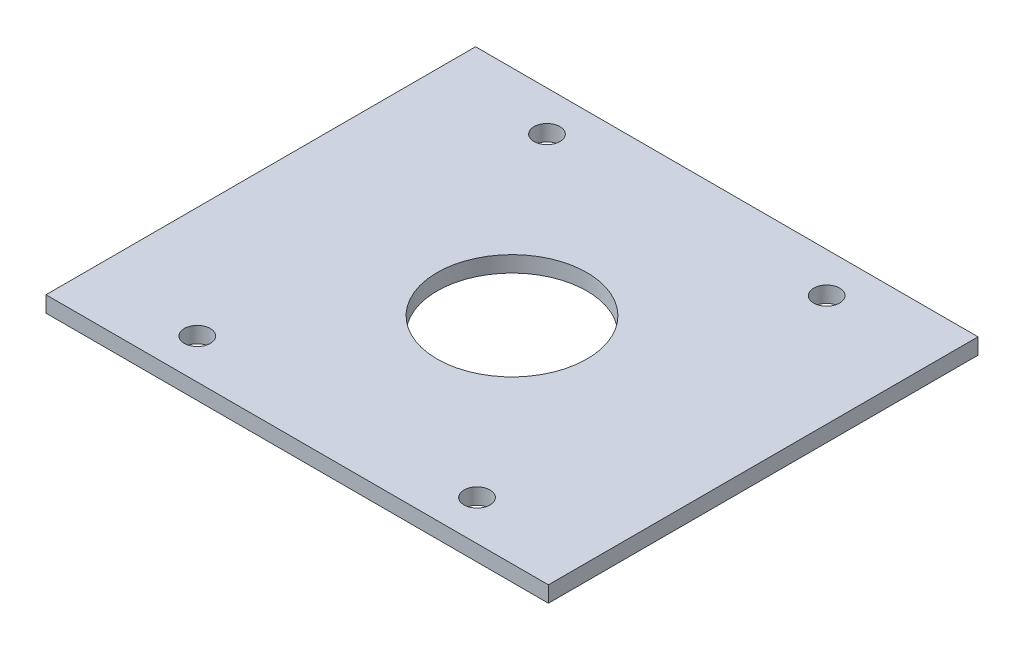
ISO-10303-21;
HEADER;
FILE_DESCRIPTION(('STEP AP214'),'2;1');
FILE_NAME('part.step','',(''),(''),'','','');
FILE_SCHEMA(('AUTOMOTIVE_DESIGN { 1 0 10303 214 1 1 1 1 }'));
ENDSEC;
DATA;
#1=APPLICATION_CONTEXT('core data for automotive mechanical design processes');
#2=APPLICATION_PROTOCOL_DEFINITION('international standard','automotive_design',2000,#1);
#3=PRODUCT_CONTEXT('',#1,'mechanical');
#4=PRODUCT('Part','Part','',(#3));
#5=PRODUCT_RELATED_PRODUCT_CATEGORY('part','',(#4));
#6=PRODUCT_DEFINITION_FORMATION('','',#4);
#7=PRODUCT_DEFINITION_CONTEXT('part definition',#1,'design');
#8=PRODUCT_DEFINITION('design','',#6,#7);
#9=PRODUCT_DEFINITION_SHAPE('','',#8);
#10=(LENGTH_UNIT() NAMED_UNIT(*) SI_UNIT(.MILLI.,.METRE.));
#11=(NAMED_UNIT(*) PLANE_ANGLE_UNIT() SI_UNIT($,.RADIAN.));
#12=(NAMED_UNIT(*) SI_UNIT($,.STERADIAN.) SOLID_ANGLE_UNIT());
#13=UNCERTAINTY_MEASURE_WITH_UNIT(LENGTH_MEASURE(1.E-05),#10,'distance_accuracy_value','');
#14=(GEOMETRIC_REPRESENTATION_CONTEXT(3) GLOBAL_UNCERTAINTY_ASSIGNED_CONTEXT((#13)) GLOBAL_UNIT_ASSIGNED_CONTEXT((#10,
#11,#12)) REPRESENTATION_CONTEXT('',''));
#15=CARTESIAN_POINT('',(0.,0.,0.));
#16=DIRECTION('',(0.,0.,1.));
#17=DIRECTION('',(1.,0.,0.));
#18=AXIS2_PLACEMENT_3D('',#15,#16,#17);
#19=CARTESIAN_POINT('',(0.,1.6,0.));
#20=DIRECTION('',(0.,1.,0.));
#21=DIRECTION('',(0.,0.,1.));
#22=AXIS2_PLACEMENT_3D('',#19,#20,#21);
#23=PLANE('',#22);
#24=CARTESIAN_POINT('',(-14.,1.6,17.5));
#25=DIRECTION('',(0.,1.,0.));
#26=DIRECTION('',(0.,0.,-1.));
#27=AXIS2_PLACEMENT_3D('',#24,#25,#26);
#28=CIRCLE('',#27,1.3);
#29=CARTESIAN_POINT('',(-14.,1.6,16.2));
#30=VERTEX_POINT('',#29);
#31=EDGE_CURVE('E131',#30,#30,#28,.T.);
#32=ORIENTED_EDGE('',*,*,#31,.F.);
#33=EDGE_LOOP('',(#32));
#34=FACE_BOUND('',#33,.T.);
#35=CARTESIAN_POINT('',(14.,1.6,17.5));
#36=DIRECTION('',(0.,1.,0.));
#37=DIRECTION('',(0.,0.,1.));
#38=AXIS2_PLACEMENT_3D('',#35,#36,#37);
#39=CIRCLE('',#38,1.3);
#40=CARTESIAN_POINT('',(14.,1.6,18.8));
#41=VERTEX_POINT('',#40);
#42=EDGE_CURVE('E137',#41,#41,#39,.T.);
#43=ORIENTED_EDGE('',*,*,#42,.F.);
#44=EDGE_LOOP('',(#43));
#45=FACE_BOUND('',#44,.T.);
#46=CARTESIAN_POINT('',(14.,1.6,-17.5));
#47=DIRECTION('',(0.,1.,0.));
#48=DIRECTION('',(0.,0.,-1.));
#49=AXIS2_PLACEMENT_3D('',#46,#47,#48);
#50=CIRCLE('',#49,1.3);
#51=CARTESIAN_POINT('',(14.,1.6,-18.8));
#52=VERTEX_POINT('',#51);
#53=EDGE_CURVE('E125',#52,#52,#50,.T.);
#54=ORIENTED_EDGE('',*,*,#53,.F.);
#55=EDGE_LOOP('',(#54));
#56=FACE_BOUND('',#55,.T.);
#57=CARTESIAN_POINT('',(-14.,1.6,-17.5));
#58=DIRECTION('',(0.,1.,0.));
#59=DIRECTION('',(0.,0.,1.));
#60=AXIS2_PLACEMENT_3D('',#57,#58,#59);
#61=CIRCLE('',#60,1.3);
#62=CARTESIAN_POINT('',(-14.,1.6,-16.2));
#63=VERTEX_POINT('',#62);
#64=EDGE_CURVE('E119',#63,#63,#61,.T.);
#65=ORIENTED_EDGE('',*,*,#64,.F.);
#66=EDGE_LOOP('',(#65));
#67=FACE_BOUND('',#66,.T.);
#68=DIRECTION('',(0.,0.,-1.));
#69=VECTOR('',#68,1.);
#70=CARTESIAN_POINT('',(25.146,1.6,-21.5));
#71=LINE('',#70,#69);
#72=CARTESIAN_POINT('',(25.146,1.6,21.5));
#73=VERTEX_POINT('',#72);
#74=CARTESIAN_POINT('',(25.146,1.6,-21.5));
#75=VERTEX_POINT('',#74);
#76=EDGE_CURVE('E89',#73,#75,#71,.T.);
#77=ORIENTED_EDGE('',*,*,#76,.T.);
#78=DIRECTION('',(-1.,0.,0.));
#79=VECTOR('',#78,1.);
#80=CARTESIAN_POINT('',(-25.146,1.6,-21.5));
#81=LINE('',#80,#79);
#82=CARTESIAN_POINT('',(-25.146,1.6,-21.5));
#83=VERTEX_POINT('',#82);
#84=EDGE_CURVE('E84',#75,#83,#81,.T.);
#85=ORIENTED_EDGE('',*,*,#84,.T.);
#86=DIRECTION('',(0.,0.,1.));
#87=VECTOR('',#86,1.);
#88=CARTESIAN_POINT('',(-25.146,1.6,-21.5));
#89=LINE('',#88,#87);
#90=CARTESIAN_POINT('',(-25.146,1.6,21.5));
#91=VERTEX_POINT('',#90);
#92=EDGE_CURVE('E87',#83,#91,#89,.T.);
#93=ORIENTED_EDGE('',*,*,#92,.T.);
#94=DIRECTION('',(1.,0.,0.));
#95=VECTOR('',#94,1.);
#96=CARTESIAN_POINT('',(-25.146,1.6,21.5));
#97=LINE('',#96,#95);
#98=EDGE_CURVE('E54',#91,#73,#97,.T.);
#99=ORIENTED_EDGE('',*,*,#98,.T.);
#100=EDGE_LOOP('',(#77,#85,#93,#99));
#101=FACE_BOUND('',#100,.T.);
#102=CARTESIAN_POINT('',(0.,1.6,0.));
#103=DIRECTION('',(0.,1.,0.));
#104=DIRECTION('',(0.,0.,1.));
#105=AXIS2_PLACEMENT_3D('',#102,#103,#104);
#106=CIRCLE('',#105,7.5);
#107=CARTESIAN_POINT('',(0.,1.6,7.5));
#108=VERTEX_POINT('',#107);
#109=EDGE_CURVE('E104',#108,#108,#106,.T.);
#110=ORIENTED_EDGE('',*,*,#109,.F.);
#111=EDGE_LOOP('',(#110));
#112=FACE_BOUND('',#111,.T.);
#113=ADVANCED_FACE('F37',(#34,#45,#56,#67,#101,#112),#23,.T.);
#114=CARTESIAN_POINT('',(0.,0.,0.));
#115=DIRECTION('',(0.,1.,0.));
#116=DIRECTION('',(0.,0.,1.));
#117=AXIS2_PLACEMENT_3D('',#114,#115,#116);
#118=PLANE('',#117);
#119=CARTESIAN_POINT('',(-14.,0.,17.5));
#120=DIRECTION('',(0.,1.,0.));
#121=DIRECTION('',(0.,0.,-1.));
#122=AXIS2_PLACEMENT_3D('',#119,#120,#121);
#123=CIRCLE('',#122,1.3);
#124=CARTESIAN_POINT('',(-14.,0.,16.2));
#125=VERTEX_POINT('',#124);
#126=EDGE_CURVE('E128',#125,#125,#123,.T.);
#127=ORIENTED_EDGE('',*,*,#126,.T.);
#128=EDGE_LOOP('',(#127));
#129=FACE_BOUND('',#128,.T.);
#130=CARTESIAN_POINT('',(14.,0.,17.5));
#131=DIRECTION('',(0.,1.,0.));
#132=DIRECTION('',(0.,0.,1.));
#133=AXIS2_PLACEMENT_3D('',#130,#131,#132);
#134=CIRCLE('',#133,1.3);
#135=CARTESIAN_POINT('',(14.,0.,18.8));
#136=VERTEX_POINT('',#135);
#137=EDGE_CURVE('E134',#136,#136,#134,.T.);
#138=ORIENTED_EDGE('',*,*,#137,.T.);
#139=EDGE_LOOP('',(#138));
#140=FACE_BOUND('',#139,.T.);
#141=CARTESIAN_POINT('',(14.,0.,-17.5));
#142=DIRECTION('',(0.,1.,0.));
#143=DIRECTION('',(0.,0.,-1.));
#144=AXIS2_PLACEMENT_3D('',#141,#142,#143);
#145=CIRCLE('',#144,1.3);
#146=CARTESIAN_POINT('',(14.,0.,-18.8));
#147=VERTEX_POINT('',#146);
#148=EDGE_CURVE('E140',#147,#147,#145,.T.);
#149=ORIENTED_EDGE('',*,*,#148,.T.);
#150=EDGE_LOOP('',(#149));
#151=FACE_BOUND('',#150,.T.);
#152=CARTESIAN_POINT('',(-14.,0.,-17.5));
#153=DIRECTION('',(0.,1.,0.));
#154=DIRECTION('',(0.,0.,1.));
#155=AXIS2_PLACEMENT_3D('',#152,#153,#154);
#156=CIRCLE('',#155,1.3);
#157=CARTESIAN_POINT('',(-14.,0.,-16.2));
#158=VERTEX_POINT('',#157);
#159=EDGE_CURVE('E122',#158,#158,#156,.T.);
#160=ORIENTED_EDGE('',*,*,#159,.T.);
#161=EDGE_LOOP('',(#160));
#162=FACE_BOUND('',#161,.T.);
#163=DIRECTION('',(0.,0.,-1.));
#164=VECTOR('',#163,1.);
#165=CARTESIAN_POINT('',(25.146,0.,-21.5));
#166=LINE('',#165,#164);
#167=CARTESIAN_POINT('',(25.146,0.,21.5));
#168=VERTEX_POINT('',#167);
#169=CARTESIAN_POINT('',(25.146,0.,-21.5));
#170=VERTEX_POINT('',#169);
#171=EDGE_CURVE('E101',#168,#170,#166,.T.);
#172=ORIENTED_EDGE('',*,*,#171,.F.);
#173=DIRECTION('',(1.,0.,0.));
#174=VECTOR('',#173,1.);
#175=CARTESIAN_POINT('',(-25.146,0.,21.5));
#176=LINE('',#175,#174);
#177=CARTESIAN_POINT('',(-25.146,0.,21.5));
#178=VERTEX_POINT('',#177);
#179=EDGE_CURVE('E77',#178,#168,#176,.T.);
#180=ORIENTED_EDGE('',*,*,#179,.F.);
#181=DIRECTION('',(0.,0.,1.));
#182=VECTOR('',#181,1.);
#183=CARTESIAN_POINT('',(-25.146,0.,-21.5));
#184=LINE('',#183,#182);
#185=CARTESIAN_POINT('',(-25.146,0.,-21.5));
#186=VERTEX_POINT('',#185);
#187=EDGE_CURVE('E71',#186,#178,#184,.T.);
#188=ORIENTED_EDGE('',*,*,#187,.F.);
#189=DIRECTION('',(-1.,0.,0.));
#190=VECTOR('',#189,1.);
#191=CARTESIAN_POINT('',(-25.146,0.,-21.5));
#192=LINE('',#191,#190);
#193=EDGE_CURVE('E93',#170,#186,#192,.T.);
#194=ORIENTED_EDGE('',*,*,#193,.F.);
#195=EDGE_LOOP('',(#172,#180,#188,#194));
#196=FACE_BOUND('',#195,.T.);
#197=CARTESIAN_POINT('',(0.,0.,0.));
#198=DIRECTION('',(0.,1.,0.));
#199=DIRECTION('',(0.,0.,1.));
#200=AXIS2_PLACEMENT_3D('',#197,#198,#199);
#201=CIRCLE('',#200,7.5);
#202=CARTESIAN_POINT('',(0.,0.,7.5));
#203=VERTEX_POINT('',#202);
#204=EDGE_CURVE('E116',#203,#203,#201,.T.);
#205=ORIENTED_EDGE('',*,*,#204,.T.);
#206=EDGE_LOOP('',(#205));
#207=FACE_BOUND('',#206,.T.);
#208=ADVANCED_FACE('F112',(#129,#140,#151,#162,#196,#207),#118,.F.);
#209=CARTESIAN_POINT('',(25.146,1.6,-21.5));
#210=DIRECTION('',(-1.,0.,0.));
#211=DIRECTION('',(0.,0.,1.));
#212=AXIS2_PLACEMENT_3D('',#209,#210,#211);
#213=PLANE('',#212);
#214=ORIENTED_EDGE('',*,*,#171,.T.);
#215=DIRECTION('',(0.,-1.,0.));
#216=VECTOR('',#215,1.);
#217=CARTESIAN_POINT('',(25.146,1.6,-21.5));
#218=LINE('',#217,#216);
#219=EDGE_CURVE('E11',#75,#170,#218,.T.);
#220=ORIENTED_EDGE('',*,*,#219,.F.);
#221=ORIENTED_EDGE('',*,*,#76,.F.);
#222=DIRECTION('',(0.,-1.,0.));
#223=VECTOR('',#222,1.);
#224=CARTESIAN_POINT('',(25.146,1.6,21.5));
#225=LINE('',#224,#223);
#226=EDGE_CURVE('E97',#73,#168,#225,.T.);
#227=ORIENTED_EDGE('',*,*,#226,.T.);
#228=EDGE_LOOP('',(#214,#220,#221,#227));
#229=FACE_BOUND('',#228,.T.);
#230=ADVANCED_FACE('F39',(#229),#213,.F.);
#231=CARTESIAN_POINT('',(-25.146,1.6,-21.5));
#232=DIRECTION('',(0.,0.,1.));
#233=DIRECTION('',(1.,0.,0.));
#234=AXIS2_PLACEMENT_3D('',#231,#232,#233);
#235=PLANE('',#234);
#236=ORIENTED_EDGE('',*,*,#193,.T.);
#237=DIRECTION('',(0.,-1.,0.));
#238=VECTOR('',#237,1.);
#239=CARTESIAN_POINT('',(-25.146,1.6,-21.5));
#240=LINE('',#239,#238);
#241=EDGE_CURVE('E46',#83,#186,#240,.T.);
#242=ORIENTED_EDGE('',*,*,#241,.F.);
#243=ORIENTED_EDGE('',*,*,#84,.F.);
#244=ORIENTED_EDGE('',*,*,#219,.T.);
#245=EDGE_LOOP('',(#236,#242,#243,#244));
#246=FACE_BOUND('',#245,.T.);
#247=ADVANCED_FACE('F92',(#246),#235,.F.);
#248=CARTESIAN_POINT('',(-25.146,1.6,-21.5));
#249=DIRECTION('',(1.,0.,0.));
#250=DIRECTION('',(0.,0.,-1.));
#251=AXIS2_PLACEMENT_3D('',#248,#249,#250);
#252=PLANE('',#251);
#253=ORIENTED_EDGE('',*,*,#187,.T.);
#254=DIRECTION('',(0.,-1.,0.));
#255=VECTOR('',#254,1.);
#256=CARTESIAN_POINT('',(-25.146,1.6,21.5));
#257=LINE('',#256,#255);
#258=EDGE_CURVE('E94',#91,#178,#257,.T.);
#259=ORIENTED_EDGE('',*,*,#258,.F.);
#260=ORIENTED_EDGE('',*,*,#92,.F.);
#261=ORIENTED_EDGE('',*,*,#241,.T.);
#262=EDGE_LOOP('',(#253,#259,#260,#261));
#263=FACE_BOUND('',#262,.T.);
#264=ADVANCED_FACE('F95',(#263),#252,.F.);
#265=CARTESIAN_POINT('',(-25.146,1.6,21.5));
#266=DIRECTION('',(0.,0.,-1.));
#267=DIRECTION('',(-1.,0.,0.));
#268=AXIS2_PLACEMENT_3D('',#265,#266,#267);
#269=PLANE('',#268);
#270=ORIENTED_EDGE('',*,*,#179,.T.);
#271=ORIENTED_EDGE('',*,*,#226,.F.);
#272=ORIENTED_EDGE('',*,*,#98,.F.);
#273=ORIENTED_EDGE('',*,*,#258,.T.);
#274=EDGE_LOOP('',(#270,#271,#272,#273));
#275=FACE_BOUND('',#274,.T.);
#276=ADVANCED_FACE('F109',(#275),#269,.F.);
#277=CARTESIAN_POINT('',(0.,1.6,0.));
#278=DIRECTION('',(0.,-1.,0.));
#279=DIRECTION('',(0.,0.,-1.));
#280=AXIS2_PLACEMENT_3D('',#277,#278,#279);
#281=CYLINDRICAL_SURFACE('',#280,7.5);
#282=ORIENTED_EDGE('',*,*,#109,.T.);
#283=EDGE_LOOP('',(#282));
#284=FACE_BOUND('',#283,.T.);
#285=ORIENTED_EDGE('',*,*,#204,.F.);
#286=EDGE_LOOP('',(#285));
#287=FACE_BOUND('',#286,.T.);
#288=ADVANCED_FACE('F158',(#284,#287),#281,.F.);
#289=CARTESIAN_POINT('',(-14.,1.6,-17.5));
#290=DIRECTION('',(0.,-1.,0.));
#291=DIRECTION('',(0.,0.,-1.));
#292=AXIS2_PLACEMENT_3D('',#289,#290,#291);
#293=CYLINDRICAL_SURFACE('',#292,1.3);
#294=ORIENTED_EDGE('',*,*,#64,.T.);
#295=EDGE_LOOP('',(#294));
#296=FACE_BOUND('',#295,.T.);
#297=ORIENTED_EDGE('',*,*,#159,.F.);
#298=EDGE_LOOP('',(#297));
#299=FACE_BOUND('',#298,.T.);
#300=ADVANCED_FACE('F155',(#296,#299),#293,.F.);
#301=CARTESIAN_POINT('',(14.,1.6,-17.5));
#302=DIRECTION('',(0.,-1.,0.));
#303=DIRECTION('',(0.,0.,-1.));
#304=AXIS2_PLACEMENT_3D('',#301,#302,#303);
#305=CYLINDRICAL_SURFACE('',#304,1.3);
#306=ORIENTED_EDGE('',*,*,#53,.T.);
#307=EDGE_LOOP('',(#306));
#308=FACE_BOUND('',#307,.T.);
#309=ORIENTED_EDGE('',*,*,#148,.F.);
#310=EDGE_LOOP('',(#309));
#311=FACE_BOUND('',#310,.T.);
#312=ADVANCED_FACE('F146',(#308,#311),#305,.F.);
#313=CARTESIAN_POINT('',(14.,1.6,17.5));
#314=DIRECTION('',(0.,-1.,0.));
#315=DIRECTION('',(0.,0.,-1.));
#316=AXIS2_PLACEMENT_3D('',#313,#314,#315);
#317=CYLINDRICAL_SURFACE('',#316,1.3);
#318=ORIENTED_EDGE('',*,*,#42,.T.);
#319=EDGE_LOOP('',(#318));
#320=FACE_BOUND('',#319,.T.);
#321=ORIENTED_EDGE('',*,*,#137,.F.);
#322=EDGE_LOOP('',(#321));
#323=FACE_BOUND('',#322,.T.);
#324=ADVANCED_FACE('F204',(#320,#323),#317,.F.);
#325=CARTESIAN_POINT('',(-14.,1.6,17.5));
#326=DIRECTION('',(0.,-1.,0.));
#327=DIRECTION('',(0.,0.,-1.));
#328=AXIS2_PLACEMENT_3D('',#325,#326,#327);
#329=CYLINDRICAL_SURFACE('',#328,1.3);
#330=ORIENTED_EDGE('',*,*,#31,.T.);
#331=EDGE_LOOP('',(#330));
#332=FACE_BOUND('',#331,.T.);
#333=ORIENTED_EDGE('',*,*,#126,.F.);
#334=EDGE_LOOP('',(#333));
#335=FACE_BOUND('',#334,.T.);
#336=ADVANCED_FACE('F211',(#332,#335),#329,.F.);
#337=CLOSED_SHELL('',(#113,#208,#230,#247,#264,#276,#288,#300,#312,#324,#336));
#338=MANIFOLD_SOLID_BREP('B2',#337);
#339=ADVANCED_BREP_SHAPE_REPRESENTATION('',(#18,#338),#14);
#340=SHAPE_DEFINITION_REPRESENTATION(#9,#339);
ENDSEC;
END-ISO-10303-21;
